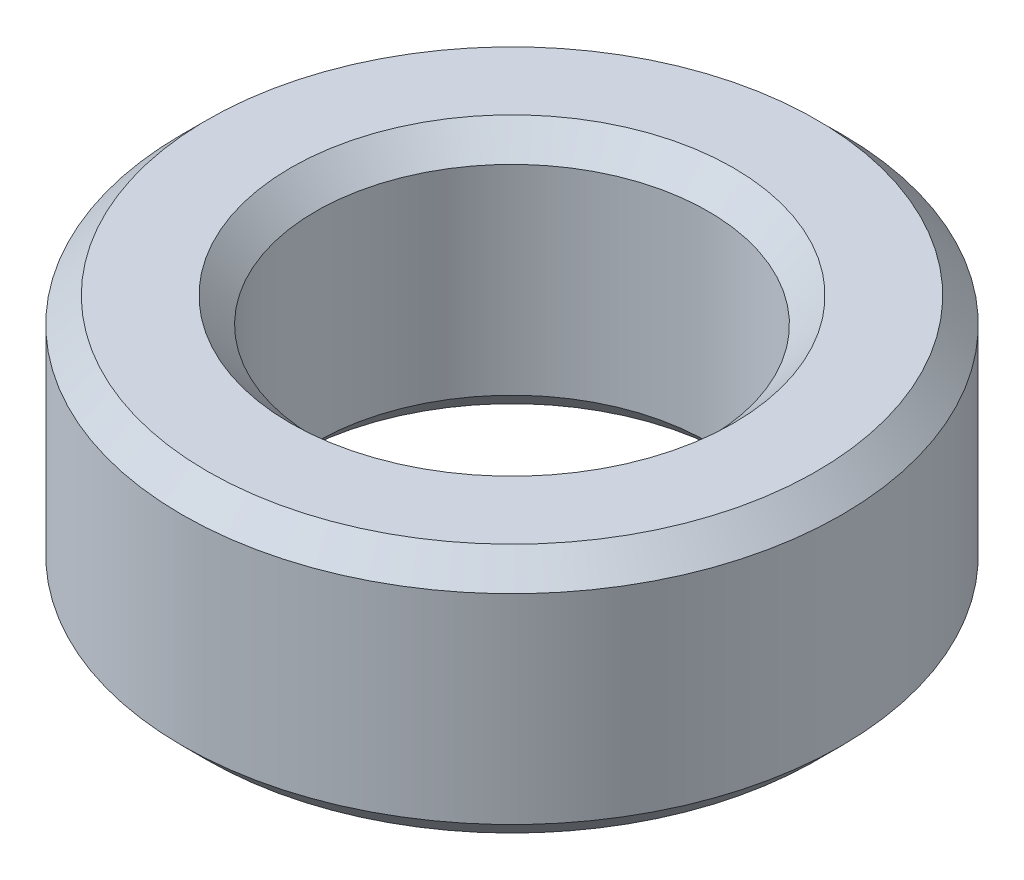
ISO-10303-21;
HEADER;
FILE_DESCRIPTION(('STEP AP214'),'2;1');
FILE_NAME('part.step','',(''),(''),'','','');
FILE_SCHEMA(('AUTOMOTIVE_DESIGN { 1 0 10303 214 1 1 1 1 }'));
ENDSEC;
DATA;
#1=APPLICATION_CONTEXT('core data for automotive mechanical design processes');
#2=APPLICATION_PROTOCOL_DEFINITION('international standard','automotive_design',2000,#1);
#3=PRODUCT_CONTEXT('',#1,'mechanical');
#4=PRODUCT('Part','Part','',(#3));
#5=PRODUCT_RELATED_PRODUCT_CATEGORY('part','',(#4));
#6=PRODUCT_DEFINITION_FORMATION('','',#4);
#7=PRODUCT_DEFINITION_CONTEXT('part definition',#1,'design');
#8=PRODUCT_DEFINITION('design','',#6,#7);
#9=PRODUCT_DEFINITION_SHAPE('','',#8);
#10=(LENGTH_UNIT() NAMED_UNIT(*) SI_UNIT(.MILLI.,.METRE.));
#11=(NAMED_UNIT(*) PLANE_ANGLE_UNIT() SI_UNIT($,.RADIAN.));
#12=(NAMED_UNIT(*) SI_UNIT($,.STERADIAN.) SOLID_ANGLE_UNIT());
#13=UNCERTAINTY_MEASURE_WITH_UNIT(LENGTH_MEASURE(1.E-05),#10,'distance_accuracy_value','');
#14=(GEOMETRIC_REPRESENTATION_CONTEXT(3) GLOBAL_UNCERTAINTY_ASSIGNED_CONTEXT((#13)) GLOBAL_UNIT_ASSIGNED_CONTEXT((#10,
#11,#12)) REPRESENTATION_CONTEXT('',''));
#15=CARTESIAN_POINT('',(0.,0.,0.));
#16=DIRECTION('',(0.,0.,1.));
#17=DIRECTION('',(1.,0.,0.));
#18=AXIS2_PLACEMENT_3D('',#15,#16,#17);
#19=CARTESIAN_POINT('',(0.,20.8658347830552,0.));
#20=DIRECTION('',(0.,-1.,0.));
#21=DIRECTION('',(0.,0.,-1.));
#22=AXIS2_PLACEMENT_3D('',#19,#20,#21);
#23=CYLINDRICAL_SURFACE('',#22,27.5);
#24=CARTESIAN_POINT('',(0.,2.09583497172407,0.));
#25=DIRECTION('',(0.,1.,0.));
#26=DIRECTION('',(0.,0.,1.));
#27=AXIS2_PLACEMENT_3D('',#24,#25,#26);
#28=CIRCLE('',#27,27.5);
#29=CARTESIAN_POINT('',(0.,2.09583497172407,27.5));
#30=VERTEX_POINT('',#29);
#31=EDGE_CURVE('E10',#30,#30,#28,.T.);
#32=ORIENTED_EDGE('',*,*,#31,.T.);
#33=EDGE_LOOP('',(#32));
#34=FACE_BOUND('',#33,.T.);
#35=CARTESIAN_POINT('',(0.,18.7699998113311,0.));
#36=DIRECTION('',(0.,1.,0.));
#37=DIRECTION('',(0.,0.,1.));
#38=AXIS2_PLACEMENT_3D('',#35,#36,#37);
#39=CIRCLE('',#38,27.5);
#40=CARTESIAN_POINT('',(0.,18.7699998113311,27.5));
#41=VERTEX_POINT('',#40);
#42=EDGE_CURVE('E50',#41,#41,#39,.F.);
#43=ORIENTED_EDGE('',*,*,#42,.T.);
#44=EDGE_LOOP('',(#43));
#45=FACE_BOUND('',#44,.T.);
#46=ADVANCED_FACE('F39',(#34,#45),#23,.T.);
#47=CARTESIAN_POINT('',(0.,20.8658347830552,0.));
#48=DIRECTION('',(0.,1.,0.));
#49=DIRECTION('',(0.,0.,1.));
#50=AXIS2_PLACEMENT_3D('',#47,#48,#49);
#51=PLANE('',#50);
#52=CARTESIAN_POINT('',(0.,20.8658347830552,0.));
#53=DIRECTION('',(0.,1.,0.));
#54=DIRECTION('',(0.,0.,1.));
#55=AXIS2_PLACEMENT_3D('',#52,#53,#54);
#56=CIRCLE('',#55,18.460899948637);
#57=CARTESIAN_POINT('',(0.,20.8658347830552,18.460899948637));
#58=VERTEX_POINT('',#57);
#59=EDGE_CURVE('E58',#58,#58,#56,.F.);
#60=ORIENTED_EDGE('',*,*,#59,.T.);
#61=EDGE_LOOP('',(#60));
#62=FACE_BOUND('',#61,.T.);
#63=CARTESIAN_POINT('',(0.,20.8658347830552,0.));
#64=DIRECTION('',(0.,1.,0.));
#65=DIRECTION('',(0.,0.,1.));
#66=AXIS2_PLACEMENT_3D('',#63,#64,#65);
#67=CIRCLE('',#66,25.4041650282759);
#68=CARTESIAN_POINT('',(0.,20.8658347830552,25.4041650282759));
#69=VERTEX_POINT('',#68);
#70=EDGE_CURVE('E61',#69,#69,#67,.T.);
#71=ORIENTED_EDGE('',*,*,#70,.T.);
#72=EDGE_LOOP('',(#71));
#73=FACE_BOUND('',#72,.T.);
#74=ADVANCED_FACE('F88',(#62,#73),#51,.T.);
#75=CARTESIAN_POINT('',(0.,0.,0.));
#76=DIRECTION('',(0.,1.,0.));
#77=DIRECTION('',(0.,0.,1.));
#78=AXIS2_PLACEMENT_3D('',#75,#76,#77);
#79=PLANE('',#78);
#80=CARTESIAN_POINT('',(0.,0.,0.));
#81=DIRECTION('',(0.,1.,0.));
#82=DIRECTION('',(0.,0.,1.));
#83=AXIS2_PLACEMENT_3D('',#80,#81,#82);
#84=CIRCLE('',#83,18.460899948637);
#85=CARTESIAN_POINT('',(0.,0.,18.460899948637));
#86=VERTEX_POINT('',#85);
#87=EDGE_CURVE('E51',#86,#86,#84,.T.);
#88=ORIENTED_EDGE('',*,*,#87,.T.);
#89=EDGE_LOOP('',(#88));
#90=FACE_BOUND('',#89,.T.);
#91=CARTESIAN_POINT('',(0.,0.,0.));
#92=DIRECTION('',(0.,1.,0.));
#93=DIRECTION('',(0.,0.,1.));
#94=AXIS2_PLACEMENT_3D('',#91,#92,#93);
#95=CIRCLE('',#94,25.4041650282759);
#96=CARTESIAN_POINT('',(0.,0.,25.4041650282759));
#97=VERTEX_POINT('',#96);
#98=EDGE_CURVE('E54',#97,#97,#95,.F.);
#99=ORIENTED_EDGE('',*,*,#98,.T.);
#100=EDGE_LOOP('',(#99));
#101=FACE_BOUND('',#100,.T.);
#102=ADVANCED_FACE('F83',(#90,#101),#79,.F.);
#103=CARTESIAN_POINT('',(0.,20.8658347830552,0.));
#104=DIRECTION('',(0.,-1.,0.));
#105=DIRECTION('',(0.,0.,-1.));
#106=AXIS2_PLACEMENT_3D('',#103,#104,#105);
#107=CYLINDRICAL_SURFACE('',#106,16.3650649769129);
#108=CARTESIAN_POINT('',(0.,18.7699998113311,0.));
#109=DIRECTION('',(0.,1.,0.));
#110=DIRECTION('',(0.,0.,1.));
#111=AXIS2_PLACEMENT_3D('',#108,#109,#110);
#112=CIRCLE('',#111,16.3650649769129);
#113=CARTESIAN_POINT('',(0.,18.7699998113311,16.3650649769129));
#114=VERTEX_POINT('',#113);
#115=EDGE_CURVE('E67',#114,#114,#112,.T.);
#116=ORIENTED_EDGE('',*,*,#115,.T.);
#117=EDGE_LOOP('',(#116));
#118=FACE_BOUND('',#117,.T.);
#119=CARTESIAN_POINT('',(0.,2.09583497172411,0.));
#120=DIRECTION('',(0.,1.,0.));
#121=DIRECTION('',(0.,0.,1.));
#122=AXIS2_PLACEMENT_3D('',#119,#120,#121);
#123=CIRCLE('',#122,16.3650649769129);
#124=CARTESIAN_POINT('',(0.,2.09583497172411,16.3650649769129));
#125=VERTEX_POINT('',#124);
#126=EDGE_CURVE('E69',#125,#125,#123,.F.);
#127=ORIENTED_EDGE('',*,*,#126,.T.);
#128=EDGE_LOOP('',(#127));
#129=FACE_BOUND('',#128,.T.);
#130=ADVANCED_FACE('F71',(#118,#129),#107,.F.);
#131=CARTESIAN_POINT('',(0.,18.7699998113311,0.));
#132=DIRECTION('',(0.,1.,0.));
#133=DIRECTION('',(0.,0.,1.));
#134=AXIS2_PLACEMENT_3D('',#131,#132,#133);
#135=CONICAL_SURFACE('',#134,16.3650649769129,0.785398163397451);
#136=ORIENTED_EDGE('',*,*,#59,.F.);
#137=EDGE_LOOP('',(#136));
#138=FACE_BOUND('',#137,.T.);
#139=ORIENTED_EDGE('',*,*,#115,.F.);
#140=EDGE_LOOP('',(#139));
#141=FACE_BOUND('',#140,.T.);
#142=ADVANCED_FACE('F77',(#138,#141),#135,.F.);
#143=CARTESIAN_POINT('',(0.,0.,0.));
#144=DIRECTION('',(0.,-1.,0.));
#145=DIRECTION('',(0.,0.,-1.));
#146=AXIS2_PLACEMENT_3D('',#143,#144,#145);
#147=CONICAL_SURFACE('',#146,18.460899948637,0.785398163397446);
#148=ORIENTED_EDGE('',*,*,#126,.F.);
#149=EDGE_LOOP('',(#148));
#150=FACE_BOUND('',#149,.T.);
#151=ORIENTED_EDGE('',*,*,#87,.F.);
#152=EDGE_LOOP('',(#151));
#153=FACE_BOUND('',#152,.T.);
#154=ADVANCED_FACE('F73',(#150,#153),#147,.F.);
#155=CARTESIAN_POINT('',(0.,2.09583497172407,0.));
#156=DIRECTION('',(0.,1.,0.));
#157=DIRECTION('',(0.,0.,1.));
#158=AXIS2_PLACEMENT_3D('',#155,#156,#157);
#159=CONICAL_SURFACE('',#158,27.5,0.785398163397454);
#160=ORIENTED_EDGE('',*,*,#98,.F.);
#161=EDGE_LOOP('',(#160));
#162=FACE_BOUND('',#161,.T.);
#163=ORIENTED_EDGE('',*,*,#31,.F.);
#164=EDGE_LOOP('',(#163));
#165=FACE_BOUND('',#164,.T.);
#166=ADVANCED_FACE('F76',(#162,#165),#159,.T.);
#167=CARTESIAN_POINT('',(0.,20.8658347830552,0.));
#168=DIRECTION('',(0.,-1.,0.));
#169=DIRECTION('',(0.,0.,-1.));
#170=AXIS2_PLACEMENT_3D('',#167,#168,#169);
#171=CONICAL_SURFACE('',#170,25.4041650282759,0.785398163397445);
#172=ORIENTED_EDGE('',*,*,#42,.F.);
#173=EDGE_LOOP('',(#172));
#174=FACE_BOUND('',#173,.T.);
#175=ORIENTED_EDGE('',*,*,#70,.F.);
#176=EDGE_LOOP('',(#175));
#177=FACE_BOUND('',#176,.T.);
#178=ADVANCED_FACE('F45',(#174,#177),#171,.T.);
#179=CLOSED_SHELL('',(#46,#74,#102,#130,#142,#154,#166,#178));
#180=MANIFOLD_SOLID_BREP('B2',#179);
#181=ADVANCED_BREP_SHAPE_REPRESENTATION('',(#18,#180),#14);
#182=SHAPE_DEFINITION_REPRESENTATION(#9,#181);
ENDSEC;
END-ISO-10303-21;
